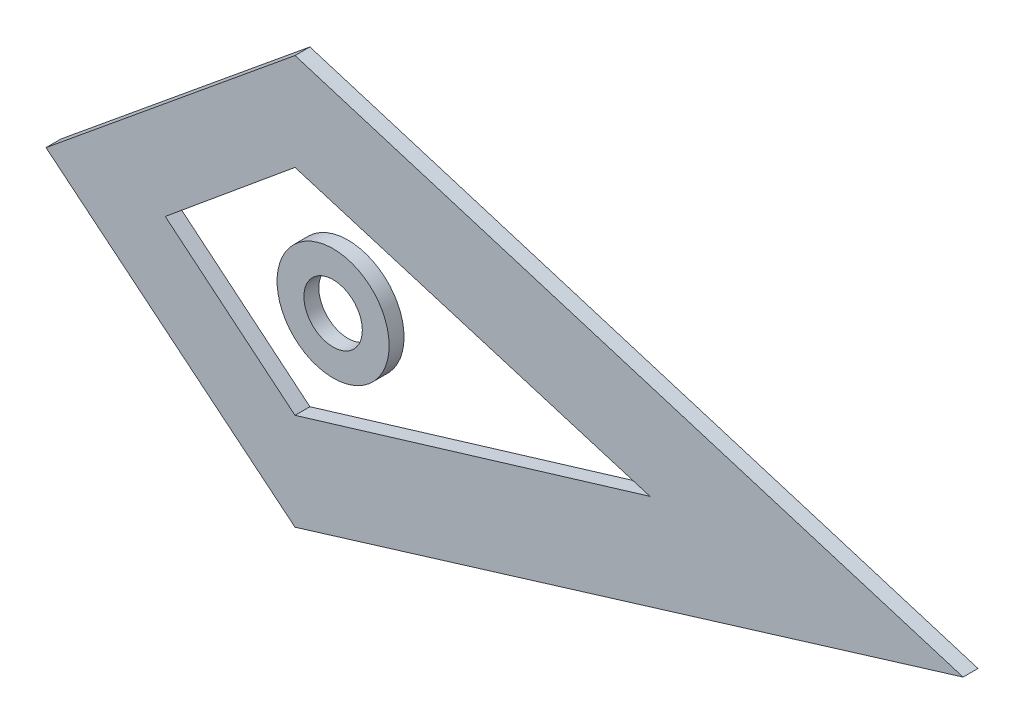
ISO-10303-21;
HEADER;
FILE_DESCRIPTION(('STEP AP214'),'2;1');
FILE_NAME('part.step','',(''),(''),'','','');
FILE_SCHEMA(('AUTOMOTIVE_DESIGN { 1 0 10303 214 1 1 1 1 }'));
ENDSEC;
DATA;
#1=APPLICATION_CONTEXT('core data for automotive mechanical design processes');
#2=APPLICATION_PROTOCOL_DEFINITION('international standard','automotive_design',2000,#1);
#3=PRODUCT_CONTEXT('',#1,'mechanical');
#4=PRODUCT('Part','Part','',(#3));
#5=PRODUCT_RELATED_PRODUCT_CATEGORY('part','',(#4));
#6=PRODUCT_DEFINITION_FORMATION('','',#4);
#7=PRODUCT_DEFINITION_CONTEXT('part definition',#1,'design');
#8=PRODUCT_DEFINITION('design','',#6,#7);
#9=PRODUCT_DEFINITION_SHAPE('','',#8);
#10=(LENGTH_UNIT() NAMED_UNIT(*) SI_UNIT(.MILLI.,.METRE.));
#11=(NAMED_UNIT(*) PLANE_ANGLE_UNIT() SI_UNIT($,.RADIAN.));
#12=(NAMED_UNIT(*) SI_UNIT($,.STERADIAN.) SOLID_ANGLE_UNIT());
#13=UNCERTAINTY_MEASURE_WITH_UNIT(LENGTH_MEASURE(1.E-05),#10,'distance_accuracy_value','');
#14=(GEOMETRIC_REPRESENTATION_CONTEXT(3) GLOBAL_UNCERTAINTY_ASSIGNED_CONTEXT((#13)) GLOBAL_UNIT_ASSIGNED_CONTEXT((#10,
#11,#12)) REPRESENTATION_CONTEXT('',''));
#15=CARTESIAN_POINT('',(0.,0.,0.));
#16=DIRECTION('',(0.,0.,1.));
#17=DIRECTION('',(1.,0.,0.));
#18=AXIS2_PLACEMENT_3D('',#15,#16,#17);
#19=CARTESIAN_POINT('',(0.,0.,2.54));
#20=DIRECTION('',(0.,0.,-1.));
#21=DIRECTION('',(-1.,0.,0.));
#22=AXIS2_PLACEMENT_3D('',#19,#20,#21);
#23=CYLINDRICAL_SURFACE('',#22,4.97452370176078);
#24=CARTESIAN_POINT('',(0.,0.,2.54));
#25=DIRECTION('',(0.,0.,1.));
#26=DIRECTION('',(1.,0.,0.));
#27=AXIS2_PLACEMENT_3D('',#24,#25,#26);
#28=CIRCLE('',#27,4.97452370176078);
#29=CARTESIAN_POINT('',(4.97452370176078,0.,2.54));
#30=VERTEX_POINT('',#29);
#31=EDGE_CURVE('E70',#30,#30,#28,.T.);
#32=ORIENTED_EDGE('',*,*,#31,.T.);
#33=EDGE_LOOP('',(#32));
#34=FACE_BOUND('',#33,.T.);
#35=CARTESIAN_POINT('',(0.,0.,0.));
#36=DIRECTION('',(0.,0.,1.));
#37=DIRECTION('',(1.,0.,0.));
#38=AXIS2_PLACEMENT_3D('',#35,#36,#37);
#39=CIRCLE('',#38,4.97452370176078);
#40=CARTESIAN_POINT('',(4.97452370176078,0.,0.));
#41=VERTEX_POINT('',#40);
#42=EDGE_CURVE('E76',#41,#41,#39,.T.);
#43=ORIENTED_EDGE('',*,*,#42,.F.);
#44=EDGE_LOOP('',(#43));
#45=FACE_BOUND('',#44,.T.);
#46=ADVANCED_FACE('F63',(#34,#45),#23,.F.);
#47=CARTESIAN_POINT('',(0.,0.,2.54));
#48=DIRECTION('',(0.,0.,-1.));
#49=DIRECTION('',(-1.,0.,0.));
#50=AXIS2_PLACEMENT_3D('',#47,#48,#49);
#51=CYLINDRICAL_SURFACE('',#50,9.54652370176078);
#52=CARTESIAN_POINT('',(0.,0.,2.54));
#53=DIRECTION('',(0.,0.,1.));
#54=DIRECTION('',(1.,0.,0.));
#55=AXIS2_PLACEMENT_3D('',#52,#53,#54);
#56=CIRCLE('',#55,9.54652370176078);
#57=CARTESIAN_POINT('',(9.54652370176078,0.,2.54));
#58=VERTEX_POINT('',#57);
#59=EDGE_CURVE('E12',#58,#58,#56,.T.);
#60=ORIENTED_EDGE('',*,*,#59,.F.);
#61=EDGE_LOOP('',(#60));
#62=FACE_BOUND('',#61,.T.);
#63=CARTESIAN_POINT('',(0.,0.,0.));
#64=DIRECTION('',(0.,0.,1.));
#65=DIRECTION('',(1.,0.,0.));
#66=AXIS2_PLACEMENT_3D('',#63,#64,#65);
#67=CIRCLE('',#66,9.54652370176078);
#68=CARTESIAN_POINT('',(9.54652370176078,0.,0.));
#69=VERTEX_POINT('',#68);
#70=EDGE_CURVE('E66',#69,#69,#67,.T.);
#71=ORIENTED_EDGE('',*,*,#70,.T.);
#72=EDGE_LOOP('',(#71));
#73=FACE_BOUND('',#72,.T.);
#74=ADVANCED_FACE('F83',(#62,#73),#51,.T.);
#75=CARTESIAN_POINT('',(0.,0.,2.54));
#76=DIRECTION('',(0.,0.,1.));
#77=DIRECTION('',(1.,0.,0.));
#78=AXIS2_PLACEMENT_3D('',#75,#76,#77);
#79=PLANE('',#78);
#80=ORIENTED_EDGE('',*,*,#31,.F.);
#81=EDGE_LOOP('',(#80));
#82=FACE_BOUND('',#81,.T.);
#83=ORIENTED_EDGE('',*,*,#59,.T.);
#84=EDGE_LOOP('',(#83));
#85=FACE_BOUND('',#84,.T.);
#86=ADVANCED_FACE('F87',(#82,#85),#79,.T.);
#87=CARTESIAN_POINT('',(0.,0.,0.));
#88=DIRECTION('',(0.,0.,1.));
#89=DIRECTION('',(1.,0.,0.));
#90=AXIS2_PLACEMENT_3D('',#87,#88,#89);
#91=PLANE('',#90);
#92=ORIENTED_EDGE('',*,*,#42,.T.);
#93=EDGE_LOOP('',(#92));
#94=FACE_BOUND('',#93,.T.);
#95=ORIENTED_EDGE('',*,*,#70,.F.);
#96=EDGE_LOOP('',(#95));
#97=FACE_BOUND('',#96,.T.);
#98=ADVANCED_FACE('F85',(#94,#97),#91,.F.);
#99=CLOSED_SHELL('',(#46,#74,#86,#98));
#100=MANIFOLD_SOLID_BREP('B2',#99);
#101=CARTESIAN_POINT('',(-11.6200655400572,-14.0451969184143,2.54));
#102=DIRECTION('',(0.637452263887145,0.77048985150043,0.));
#103=DIRECTION('',(-0.77048985150043,0.637452263887145,0.));
#104=AXIS2_PLACEMENT_3D('',#101,#102,#103);
#105=PLANE('',#104);
#106=DIRECTION('',(0.77048985150043,-0.637452263887145,0.));
#107=VECTOR('',#106,1.);
#108=CARTESIAN_POINT('',(-11.6200655400572,-14.0451969184143,0.));
#109=LINE('',#108,#107);
#110=CARTESIAN_POINT('',(-28.5965237017608,0.,0.));
#111=VERTEX_POINT('',#110);
#112=CARTESIAN_POINT('',(-6.49178080177401,-18.288,0.));
#113=VERTEX_POINT('',#112);
#114=EDGE_CURVE('E245',#111,#113,#109,.T.);
#115=ORIENTED_EDGE('',*,*,#114,.F.);
#116=DIRECTION('',(0.,0.,-1.));
#117=VECTOR('',#116,1.);
#118=CARTESIAN_POINT('',(-28.5965237017608,0.,2.54));
#119=LINE('',#118,#117);
#120=CARTESIAN_POINT('',(-28.5965237017608,0.,2.54));
#121=VERTEX_POINT('',#120);
#122=EDGE_CURVE('E61',#121,#111,#119,.T.);
#123=ORIENTED_EDGE('',*,*,#122,.F.);
#124=DIRECTION('',(0.77048985150043,-0.637452263887145,0.));
#125=VECTOR('',#124,1.);
#126=CARTESIAN_POINT('',(-11.6200655400572,-14.0451969184143,2.54));
#127=LINE('',#126,#125);
#128=CARTESIAN_POINT('',(-6.49178080177401,-18.288,2.54));
#129=VERTEX_POINT('',#128);
#130=EDGE_CURVE('E219',#121,#129,#127,.T.);
#131=ORIENTED_EDGE('',*,*,#130,.T.);
#132=DIRECTION('',(0.,0.,-1.));
#133=VECTOR('',#132,1.);
#134=CARTESIAN_POINT('',(-6.49178080177401,-18.288,2.54));
#135=LINE('',#134,#133);
#136=EDGE_CURVE('E185',#129,#113,#135,.T.);
#137=ORIENTED_EDGE('',*,*,#136,.T.);
#138=EDGE_LOOP('',(#115,#123,#131,#137));
#139=FACE_BOUND('',#138,.T.);
#140=ADVANCED_FACE('F132',(#139),#105,.T.);
#141=CARTESIAN_POINT('',(-11.6200655400572,14.0451969184143,2.54));
#142=DIRECTION('',(-0.637452263887145,0.770489851500429,0.));
#143=DIRECTION('',(-0.770489851500429,-0.637452263887145,0.));
#144=AXIS2_PLACEMENT_3D('',#141,#142,#143);
#145=PLANE('',#144);
#146=DIRECTION('',(0.77048985150043,0.637452263887145,0.));
#147=VECTOR('',#146,1.);
#148=CARTESIAN_POINT('',(-11.6200655400572,14.0451969184143,0.));
#149=LINE('',#148,#147);
#150=CARTESIAN_POINT('',(-6.49178080177401,18.288,0.));
#151=VERTEX_POINT('',#150);
#152=EDGE_CURVE('E224',#111,#151,#149,.T.);
#153=ORIENTED_EDGE('',*,*,#152,.T.);
#154=DIRECTION('',(0.,0.,-1.));
#155=VECTOR('',#154,1.);
#156=CARTESIAN_POINT('',(-6.49178080177401,18.288,2.54));
#157=LINE('',#156,#155);
#158=CARTESIAN_POINT('',(-6.49178080177401,18.288,2.54));
#159=VERTEX_POINT('',#158);
#160=EDGE_CURVE('E142',#159,#151,#157,.T.);
#161=ORIENTED_EDGE('',*,*,#160,.F.);
#162=DIRECTION('',(0.77048985150043,0.637452263887145,0.));
#163=VECTOR('',#162,1.);
#164=CARTESIAN_POINT('',(-11.6200655400572,14.0451969184143,2.54));
#165=LINE('',#164,#163);
#166=EDGE_CURVE('E215',#121,#159,#165,.T.);
#167=ORIENTED_EDGE('',*,*,#166,.F.);
#168=ORIENTED_EDGE('',*,*,#122,.T.);
#169=EDGE_LOOP('',(#153,#161,#167,#168));
#170=FACE_BOUND('',#169,.T.);
#171=ADVANCED_FACE('F222',(#170),#145,.F.);
#172=CARTESIAN_POINT('',(4.52238799342943,14.9579823944493,2.54));
#173=DIRECTION('',(0.289401654278066,0.957207753051091,0.));
#174=DIRECTION('',(-0.957207753051091,0.289401654278066,0.));
#175=AXIS2_PLACEMENT_3D('',#172,#173,#174);
#176=PLANE('',#175);
#177=DIRECTION('',(0.957207753051091,-0.289401654278066,0.));
#178=VECTOR('',#177,1.);
#179=CARTESIAN_POINT('',(4.52238799342943,14.9579823944493,0.));
#180=LINE('',#179,#178);
#181=CARTESIAN_POINT('',(53.9965237017608,0.,0.));
#182=VERTEX_POINT('',#181);
#183=EDGE_CURVE('E242',#151,#182,#180,.T.);
#184=ORIENTED_EDGE('',*,*,#183,.T.);
#185=DIRECTION('',(0.,0.,-1.));
#186=VECTOR('',#185,1.);
#187=CARTESIAN_POINT('',(53.9965237017608,0.,2.54));
#188=LINE('',#187,#186);
#189=CARTESIAN_POINT('',(53.9965237017608,0.,2.54));
#190=VERTEX_POINT('',#189);
#191=EDGE_CURVE('E214',#190,#182,#188,.T.);
#192=ORIENTED_EDGE('',*,*,#191,.F.);
#193=DIRECTION('',(0.957207753051091,-0.289401654278066,0.));
#194=VECTOR('',#193,1.);
#195=CARTESIAN_POINT('',(4.52238799342943,14.9579823944493,2.54));
#196=LINE('',#195,#194);
#197=EDGE_CURVE('E208',#159,#190,#196,.T.);
#198=ORIENTED_EDGE('',*,*,#197,.F.);
#199=ORIENTED_EDGE('',*,*,#160,.T.);
#200=EDGE_LOOP('',(#184,#192,#198,#199));
#201=FACE_BOUND('',#200,.T.);
#202=ADVANCED_FACE('F211',(#201),#176,.F.);
#203=CARTESIAN_POINT('',(-19.6737918236172,23.985733662418,2.54));
#204=DIRECTION('',(-0.634185404715115,0.773181008850014,0.));
#205=DIRECTION('',(-0.773181008850014,-0.634185404715115,0.));
#206=AXIS2_PLACEMENT_3D('',#203,#204,#205);
#207=PLANE('',#206);
#208=DIRECTION('',(0.773181008850015,0.634185404715115,0.));
#209=VECTOR('',#208,1.);
#210=CARTESIAN_POINT('',(-19.6737918236172,23.985733662418,0.));
#211=LINE('',#210,#209);
#212=CARTESIAN_POINT('',(-48.9165237017608,0.,0.));
#213=VERTEX_POINT('',#212);
#214=CARTESIAN_POINT('',(-6.49178080177401,34.798,0.));
#215=VERTEX_POINT('',#214);
#216=EDGE_CURVE('E256',#213,#215,#211,.T.);
#217=ORIENTED_EDGE('',*,*,#216,.F.);
#218=DIRECTION('',(0.,0.,-1.));
#219=VECTOR('',#218,1.);
#220=CARTESIAN_POINT('',(-48.9165237017608,0.,2.54));
#221=LINE('',#220,#219);
#222=CARTESIAN_POINT('',(-48.9165237017608,0.,2.54));
#223=VERTEX_POINT('',#222);
#224=EDGE_CURVE('E136',#223,#213,#221,.T.);
#225=ORIENTED_EDGE('',*,*,#224,.F.);
#226=DIRECTION('',(0.773181008850015,0.634185404715115,0.));
#227=VECTOR('',#226,1.);
#228=CARTESIAN_POINT('',(-19.6737918236172,23.985733662418,2.54));
#229=LINE('',#228,#227);
#230=CARTESIAN_POINT('',(-6.49178080177401,34.798,2.54));
#231=VERTEX_POINT('',#230);
#232=EDGE_CURVE('E241',#223,#231,#229,.T.);
#233=ORIENTED_EDGE('',*,*,#232,.T.);
#234=DIRECTION('',(0.,0.,-1.));
#235=VECTOR('',#234,1.);
#236=CARTESIAN_POINT('',(-6.49178080177401,34.798,2.54));
#237=LINE('',#236,#235);
#238=EDGE_CURVE('E229',#231,#215,#237,.T.);
#239=ORIENTED_EDGE('',*,*,#238,.T.);
#240=EDGE_LOOP('',(#217,#225,#233,#239));
#241=FACE_BOUND('',#240,.T.);
#242=ADVANCED_FACE('F134',(#241),#207,.T.);
#243=CARTESIAN_POINT('',(-19.6737918236172,-23.985733662418,2.54));
#244=DIRECTION('',(-0.634185404715115,-0.773181008850014,0.));
#245=DIRECTION('',(0.773181008850015,-0.634185404715115,0.));
#246=AXIS2_PLACEMENT_3D('',#243,#244,#245);
#247=PLANE('',#246);
#248=DIRECTION('',(-0.773181008850015,0.634185404715115,0.));
#249=VECTOR('',#248,1.);
#250=CARTESIAN_POINT('',(-19.6737918236172,-23.985733662418,0.));
#251=LINE('',#250,#249);
#252=CARTESIAN_POINT('',(-6.49178080177401,-34.798,0.));
#253=VERTEX_POINT('',#252);
#254=EDGE_CURVE('E253',#253,#213,#251,.T.);
#255=ORIENTED_EDGE('',*,*,#254,.F.);
#256=DIRECTION('',(0.,0.,-1.));
#257=VECTOR('',#256,1.);
#258=CARTESIAN_POINT('',(-6.49178080177401,-34.798,2.54));
#259=LINE('',#258,#257);
#260=CARTESIAN_POINT('',(-6.49178080177401,-34.798,2.54));
#261=VERTEX_POINT('',#260);
#262=EDGE_CURVE('E232',#261,#253,#259,.T.);
#263=ORIENTED_EDGE('',*,*,#262,.F.);
#264=DIRECTION('',(-0.773181008850015,0.634185404715115,0.));
#265=VECTOR('',#264,1.);
#266=CARTESIAN_POINT('',(-19.6737918236172,-23.985733662418,2.54));
#267=LINE('',#266,#265);
#268=EDGE_CURVE('E266',#261,#223,#267,.T.);
#269=ORIENTED_EDGE('',*,*,#268,.T.);
#270=ORIENTED_EDGE('',*,*,#224,.T.);
#271=EDGE_LOOP('',(#255,#263,#269,#270));
#272=FACE_BOUND('',#271,.T.);
#273=ADVANCED_FACE('F277',(#272),#247,.T.);
#274=CARTESIAN_POINT('',(9.17390366115747,-30.0089056678064,2.54));
#275=DIRECTION('',(0.292350152487735,-0.956311344876969,0.));
#276=DIRECTION('',(0.956311344876969,0.292350152487735,0.));
#277=AXIS2_PLACEMENT_3D('',#274,#275,#276);
#278=PLANE('',#277);
#279=DIRECTION('',(-0.956311344876969,-0.292350152487735,0.));
#280=VECTOR('',#279,1.);
#281=CARTESIAN_POINT('',(9.17390366115747,-30.0089056678064,0.));
#282=LINE('',#281,#280);
#283=CARTESIAN_POINT('',(107.336523701761,0.,0.));
#284=VERTEX_POINT('',#283);
#285=EDGE_CURVE('E250',#284,#253,#282,.T.);
#286=ORIENTED_EDGE('',*,*,#285,.F.);
#287=DIRECTION('',(0.,0.,-1.));
#288=VECTOR('',#287,1.);
#289=CARTESIAN_POINT('',(107.336523701761,0.,2.54));
#290=LINE('',#289,#288);
#291=CARTESIAN_POINT('',(107.336523701761,0.,2.54));
#292=VERTEX_POINT('',#291);
#293=EDGE_CURVE('E231',#292,#284,#290,.T.);
#294=ORIENTED_EDGE('',*,*,#293,.F.);
#295=DIRECTION('',(-0.956311344876969,-0.292350152487735,0.));
#296=VECTOR('',#295,1.);
#297=CARTESIAN_POINT('',(9.17390366115747,-30.0089056678064,2.54));
#298=LINE('',#297,#296);
#299=EDGE_CURVE('E264',#292,#261,#298,.T.);
#300=ORIENTED_EDGE('',*,*,#299,.T.);
#301=ORIENTED_EDGE('',*,*,#262,.T.);
#302=EDGE_LOOP('',(#286,#294,#300,#301));
#303=FACE_BOUND('',#302,.T.);
#304=ADVANCED_FACE('F278',(#303),#278,.T.);
#305=CARTESIAN_POINT('',(9.17390366115747,30.0089056678064,2.54));
#306=DIRECTION('',(0.292350152487735,0.956311344876969,0.));
#307=DIRECTION('',(-0.956311344876969,0.292350152487735,0.));
#308=AXIS2_PLACEMENT_3D('',#305,#306,#307);
#309=PLANE('',#308);
#310=DIRECTION('',(0.956311344876969,-0.292350152487735,0.));
#311=VECTOR('',#310,1.);
#312=CARTESIAN_POINT('',(9.17390366115747,30.0089056678064,0.));
#313=LINE('',#312,#311);
#314=EDGE_CURVE('E247',#215,#284,#313,.T.);
#315=ORIENTED_EDGE('',*,*,#314,.F.);
#316=ORIENTED_EDGE('',*,*,#238,.F.);
#317=DIRECTION('',(0.956311344876969,-0.292350152487735,0.));
#318=VECTOR('',#317,1.);
#319=CARTESIAN_POINT('',(9.17390366115747,30.0089056678064,2.54));
#320=LINE('',#319,#318);
#321=EDGE_CURVE('E261',#231,#292,#320,.T.);
#322=ORIENTED_EDGE('',*,*,#321,.T.);
#323=ORIENTED_EDGE('',*,*,#293,.T.);
#324=EDGE_LOOP('',(#315,#316,#322,#323));
#325=FACE_BOUND('',#324,.T.);
#326=ADVANCED_FACE('F274',(#325),#309,.T.);
#327=CARTESIAN_POINT('',(4.52238799342943,-14.9579823944493,2.54));
#328=DIRECTION('',(0.289401654278066,-0.957207753051091,0.));
#329=DIRECTION('',(0.957207753051091,0.289401654278066,0.));
#330=AXIS2_PLACEMENT_3D('',#327,#328,#329);
#331=PLANE('',#330);
#332=DIRECTION('',(-0.957207753051091,-0.289401654278066,0.));
#333=VECTOR('',#332,1.);
#334=CARTESIAN_POINT('',(4.52238799342943,-14.9579823944493,0.));
#335=LINE('',#334,#333);
#336=EDGE_CURVE('E178',#182,#113,#335,.T.);
#337=ORIENTED_EDGE('',*,*,#336,.T.);
#338=ORIENTED_EDGE('',*,*,#136,.F.);
#339=DIRECTION('',(-0.957207753051091,-0.289401654278066,0.));
#340=VECTOR('',#339,1.);
#341=CARTESIAN_POINT('',(4.52238799342943,-14.9579823944493,2.54));
#342=LINE('',#341,#340);
#343=EDGE_CURVE('E151',#190,#129,#342,.T.);
#344=ORIENTED_EDGE('',*,*,#343,.F.);
#345=ORIENTED_EDGE('',*,*,#191,.T.);
#346=EDGE_LOOP('',(#337,#338,#344,#345));
#347=FACE_BOUND('',#346,.T.);
#348=ADVANCED_FACE('F285',(#347),#331,.F.);
#349=CARTESIAN_POINT('',(0.,0.,2.54));
#350=DIRECTION('',(0.,0.,1.));
#351=DIRECTION('',(1.,0.,0.));
#352=AXIS2_PLACEMENT_3D('',#349,#350,#351);
#353=PLANE('',#352);
#354=ORIENTED_EDGE('',*,*,#232,.F.);
#355=ORIENTED_EDGE('',*,*,#268,.F.);
#356=ORIENTED_EDGE('',*,*,#299,.F.);
#357=ORIENTED_EDGE('',*,*,#321,.F.);
#358=EDGE_LOOP('',(#354,#355,#356,#357));
#359=FACE_BOUND('',#358,.T.);
#360=ORIENTED_EDGE('',*,*,#130,.F.);
#361=ORIENTED_EDGE('',*,*,#166,.T.);
#362=ORIENTED_EDGE('',*,*,#197,.T.);
#363=ORIENTED_EDGE('',*,*,#343,.T.);
#364=EDGE_LOOP('',(#360,#361,#362,#363));
#365=FACE_BOUND('',#364,.T.);
#366=ADVANCED_FACE('F218',(#359,#365),#353,.T.);
#367=CARTESIAN_POINT('',(0.,0.,0.));
#368=DIRECTION('',(0.,0.,1.));
#369=DIRECTION('',(1.,0.,0.));
#370=AXIS2_PLACEMENT_3D('',#367,#368,#369);
#371=PLANE('',#370);
#372=ORIENTED_EDGE('',*,*,#216,.T.);
#373=ORIENTED_EDGE('',*,*,#314,.T.);
#374=ORIENTED_EDGE('',*,*,#285,.T.);
#375=ORIENTED_EDGE('',*,*,#254,.T.);
#376=EDGE_LOOP('',(#372,#373,#374,#375));
#377=FACE_BOUND('',#376,.T.);
#378=ORIENTED_EDGE('',*,*,#114,.T.);
#379=ORIENTED_EDGE('',*,*,#336,.F.);
#380=ORIENTED_EDGE('',*,*,#183,.F.);
#381=ORIENTED_EDGE('',*,*,#152,.F.);
#382=EDGE_LOOP('',(#378,#379,#380,#381));
#383=FACE_BOUND('',#382,.T.);
#384=ADVANCED_FACE('F276',(#377,#383),#371,.F.);
#385=CLOSED_SHELL('',(#140,#171,#202,#242,#273,#304,#326,#348,#366,#384));
#386=MANIFOLD_SOLID_BREP('B7',#385);
#387=ADVANCED_BREP_SHAPE_REPRESENTATION('',(#18,#100,#386),#14);
#388=SHAPE_DEFINITION_REPRESENTATION(#9,#387);
ENDSEC;
END-ISO-10303-21;
